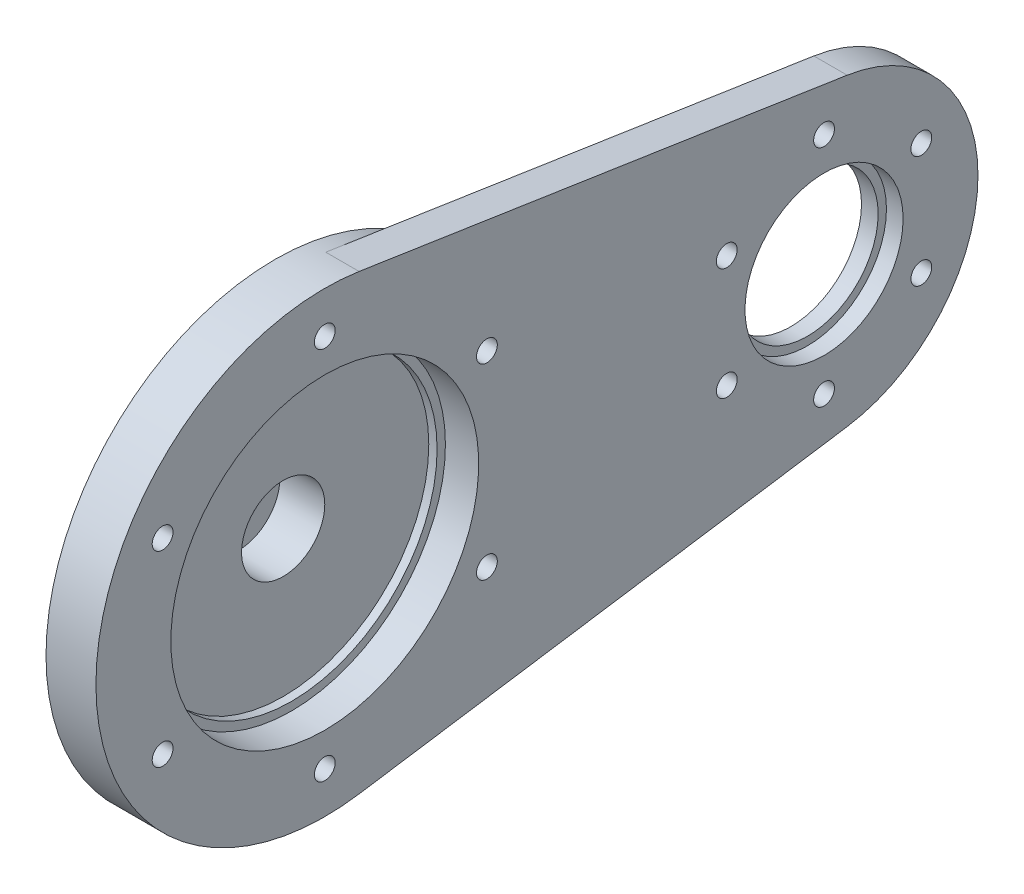
ISO-10303-21;
HEADER;
FILE_DESCRIPTION(('STEP AP214'),'2;1');
FILE_NAME('part.step','',(''),(''),'','','');
FILE_SCHEMA(('AUTOMOTIVE_DESIGN { 1 0 10303 214 1 1 1 1 }'));
ENDSEC;
DATA;
#1=APPLICATION_CONTEXT('core data for automotive mechanical design processes');
#2=APPLICATION_PROTOCOL_DEFINITION('international standard','automotive_design',2000,#1);
#3=PRODUCT_CONTEXT('',#1,'mechanical');
#4=PRODUCT('Part','Part','',(#3));
#5=PRODUCT_RELATED_PRODUCT_CATEGORY('part','',(#4));
#6=PRODUCT_DEFINITION_FORMATION('','',#4);
#7=PRODUCT_DEFINITION_CONTEXT('part definition',#1,'design');
#8=PRODUCT_DEFINITION('design','',#6,#7);
#9=PRODUCT_DEFINITION_SHAPE('','',#8);
#10=(LENGTH_UNIT() NAMED_UNIT(*) SI_UNIT(.MILLI.,.METRE.));
#11=(NAMED_UNIT(*) PLANE_ANGLE_UNIT() SI_UNIT($,.RADIAN.));
#12=(NAMED_UNIT(*) SI_UNIT($,.STERADIAN.) SOLID_ANGLE_UNIT());
#13=UNCERTAINTY_MEASURE_WITH_UNIT(LENGTH_MEASURE(1.E-05),#10,'distance_accuracy_value','');
#14=(GEOMETRIC_REPRESENTATION_CONTEXT(3) GLOBAL_UNCERTAINTY_ASSIGNED_CONTEXT((#13)) GLOBAL_UNIT_ASSIGNED_CONTEXT((#10,
#11,#12)) REPRESENTATION_CONTEXT('',''));
#15=CARTESIAN_POINT('',(0.,0.,0.));
#16=DIRECTION('',(0.,0.,1.));
#17=DIRECTION('',(1.,0.,0.));
#18=AXIS2_PLACEMENT_3D('',#15,#16,#17);
#19=CARTESIAN_POINT('',(-5.,0.,0.));
#20=DIRECTION('',(-1.,0.,0.));
#21=DIRECTION('',(0.,0.,1.));
#22=AXIS2_PLACEMENT_3D('',#19,#20,#21);
#23=PLANE('',#22);
#24=CARTESIAN_POINT('',(-5.,0.,0.));
#25=DIRECTION('',(-1.,0.,0.));
#26=DIRECTION('',(0.,0.,1.));
#27=AXIS2_PLACEMENT_3D('',#24,#25,#26);
#28=CIRCLE('',#27,9.4);
#29=CARTESIAN_POINT('',(-5.,0.,9.4));
#30=VERTEX_POINT('',#29);
#31=EDGE_CURVE('E11',#30,#30,#28,.T.);
#32=ORIENTED_EDGE('',*,*,#31,.T.);
#33=EDGE_LOOP('',(#32));
#34=FACE_BOUND('',#33,.T.);
#35=CARTESIAN_POINT('',(-5.,-7.,0.));
#36=DIRECTION('',(-1.,0.,0.));
#37=DIRECTION('',(0.,0.,1.));
#38=AXIS2_PLACEMENT_3D('',#35,#36,#37);
#39=CIRCLE('',#38,1.49999999999999);
#40=CARTESIAN_POINT('',(-5.,-7.,1.49999999999999));
#41=VERTEX_POINT('',#40);
#42=EDGE_CURVE('E109',#41,#41,#39,.T.);
#43=ORIENTED_EDGE('',*,*,#42,.F.);
#44=EDGE_LOOP('',(#43));
#45=FACE_BOUND('',#44,.T.);
#46=CARTESIAN_POINT('',(-5.,3.50000000000003,-6.06217782649105));
#47=DIRECTION('',(-1.,0.,0.));
#48=DIRECTION('',(0.,0.,1.));
#49=AXIS2_PLACEMENT_3D('',#46,#47,#48);
#50=CIRCLE('',#49,1.49999999999999);
#51=CARTESIAN_POINT('',(-5.,3.50000000000003,-4.56217782649107));
#52=VERTEX_POINT('',#51);
#53=EDGE_CURVE('E96',#52,#52,#50,.T.);
#54=ORIENTED_EDGE('',*,*,#53,.F.);
#55=EDGE_LOOP('',(#54));
#56=FACE_BOUND('',#55,.T.);
#57=CARTESIAN_POINT('',(-5.,3.49999999999994,6.0621778264911));
#58=DIRECTION('',(-1.,0.,0.));
#59=DIRECTION('',(0.,0.,1.));
#60=AXIS2_PLACEMENT_3D('',#57,#58,#59);
#61=CIRCLE('',#60,1.49999999999999);
#62=CARTESIAN_POINT('',(-5.,3.49999999999994,7.56217782649109));
#63=VERTEX_POINT('',#62);
#64=EDGE_CURVE('E97',#63,#63,#61,.T.);
#65=ORIENTED_EDGE('',*,*,#64,.F.);
#66=EDGE_LOOP('',(#65));
#67=FACE_BOUND('',#66,.T.);
#68=CARTESIAN_POINT('',(-5.,0.,0.));
#69=DIRECTION('',(1.,0.,0.));
#70=DIRECTION('',(0.,0.,-1.));
#71=AXIS2_PLACEMENT_3D('',#68,#69,#70);
#72=CIRCLE('',#71,2.65);
#73=CARTESIAN_POINT('',(-5.,0.,-2.65));
#74=VERTEX_POINT('',#73);
#75=EDGE_CURVE('E103',#74,#74,#72,.T.);
#76=ORIENTED_EDGE('',*,*,#75,.T.);
#77=EDGE_LOOP('',(#76));
#78=FACE_BOUND('',#77,.T.);
#79=ADVANCED_FACE('F36',(#34,#45,#56,#67,#78),#23,.T.);
#80=CARTESIAN_POINT('',(0.,0.,0.));
#81=DIRECTION('',(1.,0.,0.));
#82=DIRECTION('',(0.,0.,-1.));
#83=AXIS2_PLACEMENT_3D('',#80,#81,#82);
#84=PLANE('',#83);
#85=CARTESIAN_POINT('',(0.,0.,0.));
#86=DIRECTION('',(1.,0.,0.));
#87=DIRECTION('',(0.,0.,-1.));
#88=AXIS2_PLACEMENT_3D('',#85,#86,#87);
#89=CIRCLE('',#88,9.6);
#90=CARTESIAN_POINT('',(0.,0.,-9.6));
#91=VERTEX_POINT('',#90);
#92=EDGE_CURVE('E44',#91,#91,#89,.T.);
#93=ORIENTED_EDGE('',*,*,#92,.T.);
#94=EDGE_LOOP('',(#93));
#95=FACE_BOUND('',#94,.T.);
#96=CARTESIAN_POINT('',(0.,22.5,0.));
#97=DIRECTION('',(1.,0.,0.));
#98=DIRECTION('',(0.,0.,-1.));
#99=AXIS2_PLACEMENT_3D('',#96,#97,#98);
#100=CIRCLE('',#99,1.25);
#101=CARTESIAN_POINT('',(0.,22.5,-1.25));
#102=VERTEX_POINT('',#101);
#103=EDGE_CURVE('E189',#102,#102,#100,.T.);
#104=ORIENTED_EDGE('',*,*,#103,.T.);
#105=EDGE_LOOP('',(#104));
#106=FACE_BOUND('',#105,.T.);
#107=CARTESIAN_POINT('',(0.,11.25,-19.4855715851499));
#108=DIRECTION('',(1.,0.,0.));
#109=DIRECTION('',(0.,0.,-1.));
#110=AXIS2_PLACEMENT_3D('',#107,#108,#109);
#111=CIRCLE('',#110,1.25);
#112=CARTESIAN_POINT('',(0.,11.25,-20.7355715851499));
#113=VERTEX_POINT('',#112);
#114=EDGE_CURVE('E183',#113,#113,#111,.T.);
#115=ORIENTED_EDGE('',*,*,#114,.T.);
#116=EDGE_LOOP('',(#115));
#117=FACE_BOUND('',#116,.T.);
#118=CARTESIAN_POINT('',(0.,-11.2500000000001,-19.4855715851498));
#119=DIRECTION('',(1.,0.,0.));
#120=DIRECTION('',(0.,0.,-1.));
#121=AXIS2_PLACEMENT_3D('',#118,#119,#120);
#122=CIRCLE('',#121,1.25);
#123=CARTESIAN_POINT('',(0.,-11.2500000000001,-20.7355715851498));
#124=VERTEX_POINT('',#123);
#125=EDGE_CURVE('E179',#124,#124,#122,.T.);
#126=ORIENTED_EDGE('',*,*,#125,.T.);
#127=EDGE_LOOP('',(#126));
#128=FACE_BOUND('',#127,.T.);
#129=CARTESIAN_POINT('',(0.,-22.5,0.));
#130=DIRECTION('',(1.,0.,0.));
#131=DIRECTION('',(0.,0.,-1.));
#132=AXIS2_PLACEMENT_3D('',#129,#130,#131);
#133=CIRCLE('',#132,1.25);
#134=CARTESIAN_POINT('',(0.,-22.5,-1.25));
#135=VERTEX_POINT('',#134);
#136=EDGE_CURVE('E173',#135,#135,#133,.T.);
#137=ORIENTED_EDGE('',*,*,#136,.T.);
#138=EDGE_LOOP('',(#137));
#139=FACE_BOUND('',#138,.T.);
#140=CARTESIAN_POINT('',(0.,-11.2499999999998,19.48557158515));
#141=DIRECTION('',(1.,0.,0.));
#142=DIRECTION('',(0.,0.,-1.));
#143=AXIS2_PLACEMENT_3D('',#140,#141,#142);
#144=CIRCLE('',#143,1.25);
#145=CARTESIAN_POINT('',(0.,-11.2499999999998,18.23557158515));
#146=VERTEX_POINT('',#145);
#147=EDGE_CURVE('E169',#146,#146,#144,.T.);
#148=ORIENTED_EDGE('',*,*,#147,.T.);
#149=EDGE_LOOP('',(#148));
#150=FACE_BOUND('',#149,.T.);
#151=CARTESIAN_POINT('',(0.,11.2500000000002,19.4855715851497));
#152=DIRECTION('',(1.,0.,0.));
#153=DIRECTION('',(0.,0.,-1.));
#154=AXIS2_PLACEMENT_3D('',#151,#152,#153);
#155=CIRCLE('',#154,1.25);
#156=CARTESIAN_POINT('',(0.,11.2500000000002,18.2355715851497));
#157=VERTEX_POINT('',#156);
#158=EDGE_CURVE('E163',#157,#157,#155,.T.);
#159=ORIENTED_EDGE('',*,*,#158,.T.);
#160=EDGE_LOOP('',(#159));
#161=FACE_BOUND('',#160,.T.);
#162=CARTESIAN_POINT('',(0.,0.,0.));
#163=DIRECTION('',(-1.,0.,0.));
#164=DIRECTION('',(0.,0.,1.));
#165=AXIS2_PLACEMENT_3D('',#162,#163,#164);
#166=CIRCLE('',#165,25.);
#167=CARTESIAN_POINT('',(0.,0.,25.));
#168=VERTEX_POINT('',#167);
#169=EDGE_CURVE('E115',#168,#168,#166,.T.);
#170=ORIENTED_EDGE('',*,*,#169,.T.);
#171=EDGE_LOOP('',(#170));
#172=FACE_BOUND('',#171,.T.);
#173=ADVANCED_FACE('F256',(#95,#106,#117,#128,#139,#150,#161,#172),#84,.F.);
#174=CARTESIAN_POINT('',(2.,0.,0.));
#175=DIRECTION('',(-1.,0.,0.));
#176=DIRECTION('',(0.,0.,1.));
#177=AXIS2_PLACEMENT_3D('',#174,#175,#176);
#178=CYLINDRICAL_SURFACE('',#177,27.5);
#179=DIRECTION('',(1.,0.,0.));
#180=VECTOR('',#179,1.);
#181=CARTESIAN_POINT('',(3.,-27.1888649082671,-4.125));
#182=LINE('',#181,#180);
#183=CARTESIAN_POINT('',(3.,-27.1888649082671,-4.125));
#184=VERTEX_POINT('',#183);
#185=CARTESIAN_POINT('',(7.00000000000001,-27.1888649082671,-4.125));
#186=VERTEX_POINT('',#185);
#187=EDGE_CURVE('E217',#184,#186,#182,.T.);
#188=ORIENTED_EDGE('',*,*,#187,.T.);
#189=CARTESIAN_POINT('',(7.,0.,0.));
#190=DIRECTION('',(-1.,0.,0.));
#191=DIRECTION('',(0.,-1.,0.));
#192=AXIS2_PLACEMENT_3D('',#189,#190,#191);
#193=CIRCLE('',#192,27.5);
#194=CARTESIAN_POINT('',(7.,27.1888649082671,-4.125));
#195=VERTEX_POINT('',#194);
#196=EDGE_CURVE('E51',#186,#195,#193,.T.);
#197=ORIENTED_EDGE('',*,*,#196,.T.);
#198=DIRECTION('',(1.,0.,0.));
#199=VECTOR('',#198,1.);
#200=CARTESIAN_POINT('',(3.,27.1888649082671,-4.125));
#201=LINE('',#200,#199);
#202=CARTESIAN_POINT('',(3.,27.1888649082671,-4.125));
#203=VERTEX_POINT('',#202);
#204=EDGE_CURVE('E218',#203,#195,#201,.T.);
#205=ORIENTED_EDGE('',*,*,#204,.F.);
#206=CARTESIAN_POINT('',(3.,0.,0.));
#207=DIRECTION('',(-1.,0.,0.));
#208=DIRECTION('',(0.,0.,-1.));
#209=AXIS2_PLACEMENT_3D('',#206,#207,#208);
#210=CIRCLE('',#209,27.5);
#211=EDGE_CURVE('E59',#203,#184,#210,.T.);
#212=ORIENTED_EDGE('',*,*,#211,.T.);
#213=EDGE_LOOP('',(#188,#197,#205,#212));
#214=FACE_BOUND('',#213,.T.);
#215=CARTESIAN_POINT('',(1.,0.,0.));
#216=DIRECTION('',(-1.,0.,0.));
#217=DIRECTION('',(0.,0.,1.));
#218=AXIS2_PLACEMENT_3D('',#215,#216,#217);
#219=CIRCLE('',#218,27.5);
#220=CARTESIAN_POINT('',(1.,0.,27.5));
#221=VERTEX_POINT('',#220);
#222=EDGE_CURVE('E119',#221,#221,#219,.T.);
#223=ORIENTED_EDGE('',*,*,#222,.F.);
#224=EDGE_LOOP('',(#223));
#225=FACE_BOUND('',#224,.T.);
#226=ADVANCED_FACE('F325',(#214,#225),#178,.T.);
#227=CARTESIAN_POINT('',(7.,30.4496579795355,-1111.));
#228=DIRECTION('',(-1.,0.,0.));
#229=DIRECTION('',(0.,-1.,0.));
#230=AXIS2_PLACEMENT_3D('',#227,#228,#229);
#231=PLANE('',#230);
#232=CARTESIAN_POINT('',(7.,-6.7499999999999,-48.30865704891));
#233=DIRECTION('',(1.,0.,0.));
#234=DIRECTION('',(0.,0.,-1.));
#235=AXIS2_PLACEMENT_3D('',#232,#233,#234);
#236=CIRCLE('',#235,1.24999999999997);
#237=CARTESIAN_POINT('',(7.,-6.7499999999999,-49.55865704891));
#238=VERTEX_POINT('',#237);
#239=EDGE_CURVE('E130',#238,#238,#236,.T.);
#240=ORIENTED_EDGE('',*,*,#239,.F.);
#241=EDGE_LOOP('',(#240));
#242=FACE_BOUND('',#241,.T.);
#243=CARTESIAN_POINT('',(7.,13.5,-60.));
#244=DIRECTION('',(1.,0.,0.));
#245=DIRECTION('',(0.,0.,-1.));
#246=AXIS2_PLACEMENT_3D('',#243,#244,#245);
#247=CIRCLE('',#246,1.24999999999997);
#248=CARTESIAN_POINT('',(7.,13.5,-61.25));
#249=VERTEX_POINT('',#248);
#250=EDGE_CURVE('E154',#249,#249,#247,.T.);
#251=ORIENTED_EDGE('',*,*,#250,.F.);
#252=EDGE_LOOP('',(#251));
#253=FACE_BOUND('',#252,.T.);
#254=CARTESIAN_POINT('',(7.,-11.2499999999998,19.48557158515));
#255=DIRECTION('',(1.,0.,0.));
#256=DIRECTION('',(0.,0.,-1.));
#257=AXIS2_PLACEMENT_3D('',#254,#255,#256);
#258=CIRCLE('',#257,1.25);
#259=CARTESIAN_POINT('',(7.,-11.2499999999998,18.23557158515));
#260=VERTEX_POINT('',#259);
#261=EDGE_CURVE('E166',#260,#260,#258,.T.);
#262=ORIENTED_EDGE('',*,*,#261,.F.);
#263=EDGE_LOOP('',(#262));
#264=FACE_BOUND('',#263,.T.);
#265=CARTESIAN_POINT('',(7.,-22.5,0.));
#266=DIRECTION('',(1.,0.,0.));
#267=DIRECTION('',(0.,0.,-1.));
#268=AXIS2_PLACEMENT_3D('',#265,#266,#267);
#269=CIRCLE('',#268,1.25);
#270=CARTESIAN_POINT('',(7.,-22.5,-1.25));
#271=VERTEX_POINT('',#270);
#272=EDGE_CURVE('E170',#271,#271,#269,.T.);
#273=ORIENTED_EDGE('',*,*,#272,.F.);
#274=EDGE_LOOP('',(#273));
#275=FACE_BOUND('',#274,.T.);
#276=CARTESIAN_POINT('',(7.,-11.2500000000001,-19.4855715851498));
#277=DIRECTION('',(1.,0.,0.));
#278=DIRECTION('',(0.,0.,-1.));
#279=AXIS2_PLACEMENT_3D('',#276,#277,#278);
#280=CIRCLE('',#279,1.25);
#281=CARTESIAN_POINT('',(7.,-11.2500000000001,-20.7355715851498));
#282=VERTEX_POINT('',#281);
#283=EDGE_CURVE('E176',#282,#282,#280,.T.);
#284=ORIENTED_EDGE('',*,*,#283,.F.);
#285=EDGE_LOOP('',(#284));
#286=FACE_BOUND('',#285,.T.);
#287=CARTESIAN_POINT('',(7.,22.5,0.));
#288=DIRECTION('',(1.,0.,0.));
#289=DIRECTION('',(0.,0.,-1.));
#290=AXIS2_PLACEMENT_3D('',#287,#288,#289);
#291=CIRCLE('',#290,1.25);
#292=CARTESIAN_POINT('',(7.,22.5,-1.25));
#293=VERTEX_POINT('',#292);
#294=EDGE_CURVE('E186',#293,#293,#291,.T.);
#295=ORIENTED_EDGE('',*,*,#294,.F.);
#296=EDGE_LOOP('',(#295));
#297=FACE_BOUND('',#296,.T.);
#298=CARTESIAN_POINT('',(7.,0.,0.));
#299=DIRECTION('',(-1.,0.,0.));
#300=DIRECTION('',(0.,-1.,0.));
#301=AXIS2_PLACEMENT_3D('',#298,#299,#300);
#302=CIRCLE('',#301,18.5);
#303=CARTESIAN_POINT('',(7.00000000000001,-18.5,0.));
#304=VERTEX_POINT('',#303);
#305=EDGE_CURVE('E200',#304,#304,#302,.T.);
#306=ORIENTED_EDGE('',*,*,#305,.T.);
#307=EDGE_LOOP('',(#306));
#308=FACE_BOUND('',#307,.T.);
#309=CARTESIAN_POINT('',(7.,0.,-60.));
#310=DIRECTION('',(-1.,0.,0.));
#311=DIRECTION('',(0.,-1.,0.));
#312=AXIS2_PLACEMENT_3D('',#309,#310,#311);
#313=CIRCLE('',#312,9.49999999999999);
#314=CARTESIAN_POINT('',(7.00000000000001,-9.49999999999999,-60.));
#315=VERTEX_POINT('',#314);
#316=EDGE_CURVE('E192',#315,#315,#313,.F.);
#317=ORIENTED_EDGE('',*,*,#316,.F.);
#318=EDGE_LOOP('',(#317));
#319=FACE_BOUND('',#318,.T.);
#320=DIRECTION('',(0.,0.15,-0.98868599666426));
#321=VECTOR('',#320,1.);
#322=CARTESIAN_POINT('',(7.00000000000001,-27.1888649082671,-4.125));
#323=LINE('',#322,#321);
#324=CARTESIAN_POINT('',(7.00000000000001,-18.2906909382888,-62.775));
#325=VERTEX_POINT('',#324);
#326=EDGE_CURVE('E193',#186,#325,#323,.T.);
#327=ORIENTED_EDGE('',*,*,#326,.T.);
#328=CARTESIAN_POINT('',(7.,0.,-60.));
#329=DIRECTION('',(-1.,0.,0.));
#330=DIRECTION('',(0.,-1.,0.));
#331=AXIS2_PLACEMENT_3D('',#328,#329,#330);
#332=CIRCLE('',#331,18.5);
#333=CARTESIAN_POINT('',(7.,18.2906909382888,-62.775));
#334=VERTEX_POINT('',#333);
#335=EDGE_CURVE('E195',#325,#334,#332,.F.);
#336=ORIENTED_EDGE('',*,*,#335,.T.);
#337=DIRECTION('',(0.,0.15,0.98868599666426));
#338=VECTOR('',#337,1.);
#339=CARTESIAN_POINT('',(7.,27.1888649082671,-4.125));
#340=LINE('',#339,#338);
#341=EDGE_CURVE('E197',#334,#195,#340,.T.);
#342=ORIENTED_EDGE('',*,*,#341,.T.);
#343=ORIENTED_EDGE('',*,*,#196,.F.);
#344=EDGE_LOOP('',(#327,#336,#342,#343));
#345=FACE_BOUND('',#344,.T.);
#346=CARTESIAN_POINT('',(7.,11.25,-19.4855715851499));
#347=DIRECTION('',(1.,0.,0.));
#348=DIRECTION('',(0.,0.,-1.));
#349=AXIS2_PLACEMENT_3D('',#346,#347,#348);
#350=CIRCLE('',#349,1.25);
#351=CARTESIAN_POINT('',(7.,11.25,-20.7355715851499));
#352=VERTEX_POINT('',#351);
#353=EDGE_CURVE('E180',#352,#352,#350,.T.);
#354=ORIENTED_EDGE('',*,*,#353,.F.);
#355=EDGE_LOOP('',(#354));
#356=FACE_BOUND('',#355,.T.);
#357=CARTESIAN_POINT('',(7.,11.2500000000002,19.4855715851497));
#358=DIRECTION('',(1.,0.,0.));
#359=DIRECTION('',(0.,0.,-1.));
#360=AXIS2_PLACEMENT_3D('',#357,#358,#359);
#361=CIRCLE('',#360,1.25);
#362=CARTESIAN_POINT('',(7.,11.2500000000002,18.2355715851497));
#363=VERTEX_POINT('',#362);
#364=EDGE_CURVE('E160',#363,#363,#361,.T.);
#365=ORIENTED_EDGE('',*,*,#364,.F.);
#366=EDGE_LOOP('',(#365));
#367=FACE_BOUND('',#366,.T.);
#368=CARTESIAN_POINT('',(7.,6.74999999999997,-71.6913429510899));
#369=DIRECTION('',(1.,0.,0.));
#370=DIRECTION('',(0.,0.,-1.));
#371=AXIS2_PLACEMENT_3D('',#368,#369,#370);
#372=CIRCLE('',#371,1.24999999999997);
#373=CARTESIAN_POINT('',(7.,6.74999999999997,-72.9413429510899));
#374=VERTEX_POINT('',#373);
#375=EDGE_CURVE('E148',#374,#374,#372,.T.);
#376=ORIENTED_EDGE('',*,*,#375,.F.);
#377=EDGE_LOOP('',(#376));
#378=FACE_BOUND('',#377,.T.);
#379=CARTESIAN_POINT('',(7.,-6.75000000000005,-71.6913429510899));
#380=DIRECTION('',(1.,0.,0.));
#381=DIRECTION('',(0.,0.,-1.));
#382=AXIS2_PLACEMENT_3D('',#379,#380,#381);
#383=CIRCLE('',#382,1.24999999999997);
#384=CARTESIAN_POINT('',(7.,-6.75000000000005,-72.9413429510899));
#385=VERTEX_POINT('',#384);
#386=EDGE_CURVE('E142',#385,#385,#383,.T.);
#387=ORIENTED_EDGE('',*,*,#386,.F.);
#388=EDGE_LOOP('',(#387));
#389=FACE_BOUND('',#388,.T.);
#390=CARTESIAN_POINT('',(7.,-13.5,-60.));
#391=DIRECTION('',(1.,0.,0.));
#392=DIRECTION('',(0.,0.,-1.));
#393=AXIS2_PLACEMENT_3D('',#390,#391,#392);
#394=CIRCLE('',#393,1.24999999999997);
#395=CARTESIAN_POINT('',(7.,-13.5,-61.25));
#396=VERTEX_POINT('',#395);
#397=EDGE_CURVE('E136',#396,#396,#394,.T.);
#398=ORIENTED_EDGE('',*,*,#397,.F.);
#399=EDGE_LOOP('',(#398));
#400=FACE_BOUND('',#399,.T.);
#401=CARTESIAN_POINT('',(7.,6.75000000000014,-48.3086570489102));
#402=DIRECTION('',(1.,0.,0.));
#403=DIRECTION('',(0.,0.,-1.));
#404=AXIS2_PLACEMENT_3D('',#401,#402,#403);
#405=CIRCLE('',#404,1.24999999999997);
#406=CARTESIAN_POINT('',(7.,6.75000000000014,-49.5586570489101));
#407=VERTEX_POINT('',#406);
#408=EDGE_CURVE('E124',#407,#407,#405,.T.);
#409=ORIENTED_EDGE('',*,*,#408,.F.);
#410=EDGE_LOOP('',(#409));
#411=FACE_BOUND('',#410,.T.);
#412=ADVANCED_FACE('F317',(#242,#253,#264,#275,#286,#297,#308,#319,#345,#356,#367,#378,#389,
#400,#411),#231,.F.);
#413=CARTESIAN_POINT('',(3.,0.,0.));
#414=DIRECTION('',(1.,0.,0.));
#415=DIRECTION('',(0.,0.,-1.));
#416=AXIS2_PLACEMENT_3D('',#413,#414,#415);
#417=PLANE('',#416);
#418=CARTESIAN_POINT('',(3.,0.,0.));
#419=DIRECTION('',(1.,0.,0.));
#420=DIRECTION('',(0.,0.,-1.));
#421=AXIS2_PLACEMENT_3D('',#418,#419,#420);
#422=CIRCLE('',#421,17.5);
#423=CARTESIAN_POINT('',(3.,0.,-17.5));
#424=VERTEX_POINT('',#423);
#425=EDGE_CURVE('E232',#424,#424,#422,.T.);
#426=ORIENTED_EDGE('',*,*,#425,.F.);
#427=EDGE_LOOP('',(#426));
#428=FACE_BOUND('',#427,.T.);
#429=CARTESIAN_POINT('',(3.,0.,0.));
#430=DIRECTION('',(1.,0.,0.));
#431=DIRECTION('',(0.,0.,-1.));
#432=AXIS2_PLACEMENT_3D('',#429,#430,#431);
#433=CIRCLE('',#432,18.5);
#434=CARTESIAN_POINT('',(3.,0.,-18.5));
#435=VERTEX_POINT('',#434);
#436=EDGE_CURVE('E221',#435,#435,#433,.T.);
#437=ORIENTED_EDGE('',*,*,#436,.T.);
#438=EDGE_LOOP('',(#437));
#439=FACE_BOUND('',#438,.T.);
#440=ADVANCED_FACE('F311',(#428,#439),#417,.T.);
#441=CARTESIAN_POINT('',(3.,0.,0.));
#442=DIRECTION('',(-1.,0.,0.));
#443=DIRECTION('',(0.,0.,1.));
#444=AXIS2_PLACEMENT_3D('',#441,#442,#443);
#445=CYLINDRICAL_SURFACE('',#444,17.5);
#446=ORIENTED_EDGE('',*,*,#425,.T.);
#447=EDGE_LOOP('',(#446));
#448=FACE_BOUND('',#447,.T.);
#449=CARTESIAN_POINT('',(2.,0.,0.));
#450=DIRECTION('',(1.,0.,0.));
#451=DIRECTION('',(0.,0.,-1.));
#452=AXIS2_PLACEMENT_3D('',#449,#450,#451);
#453=CIRCLE('',#452,17.5);
#454=CARTESIAN_POINT('',(2.,0.,-17.5));
#455=VERTEX_POINT('',#454);
#456=EDGE_CURVE('E235',#455,#455,#453,.F.);
#457=ORIENTED_EDGE('',*,*,#456,.T.);
#458=EDGE_LOOP('',(#457));
#459=FACE_BOUND('',#458,.T.);
#460=ADVANCED_FACE('F306',(#448,#459),#445,.F.);
#461=CARTESIAN_POINT('',(2.,0.,0.));
#462=DIRECTION('',(1.,0.,0.));
#463=DIRECTION('',(0.,0.,-1.));
#464=AXIS2_PLACEMENT_3D('',#461,#462,#463);
#465=PLANE('',#464);
#466=CARTESIAN_POINT('',(2.,0.,0.));
#467=DIRECTION('',(1.,0.,0.));
#468=DIRECTION('',(0.,0.,-1.));
#469=AXIS2_PLACEMENT_3D('',#466,#467,#468);
#470=CIRCLE('',#469,5.);
#471=CARTESIAN_POINT('',(2.,0.,-5.));
#472=VERTEX_POINT('',#471);
#473=EDGE_CURVE('E297',#472,#472,#470,.T.);
#474=ORIENTED_EDGE('',*,*,#473,.F.);
#475=EDGE_LOOP('',(#474));
#476=FACE_BOUND('',#475,.T.);
#477=ORIENTED_EDGE('',*,*,#456,.F.);
#478=EDGE_LOOP('',(#477));
#479=FACE_BOUND('',#478,.T.);
#480=ADVANCED_FACE('F303',(#476,#479),#465,.T.);
#481=CARTESIAN_POINT('',(10.,0.,0.));
#482=DIRECTION('',(-1.,0.,0.));
#483=DIRECTION('',(0.,0.,1.));
#484=AXIS2_PLACEMENT_3D('',#481,#482,#483);
#485=CYLINDRICAL_SURFACE('',#484,18.5);
#486=ORIENTED_EDGE('',*,*,#305,.F.);
#487=EDGE_LOOP('',(#486));
#488=FACE_BOUND('',#487,.T.);
#489=ORIENTED_EDGE('',*,*,#436,.F.);
#490=EDGE_LOOP('',(#489));
#491=FACE_BOUND('',#490,.T.);
#492=ADVANCED_FACE('F269',(#488,#491),#485,.F.);
#493=CARTESIAN_POINT('',(-5.,0.,0.));
#494=DIRECTION('',(1.,0.,0.));
#495=DIRECTION('',(0.,0.,-1.));
#496=AXIS2_PLACEMENT_3D('',#493,#494,#495);
#497=CYLINDRICAL_SURFACE('',#496,9.5);
#498=CARTESIAN_POINT('',(-0.1,0.,0.));
#499=DIRECTION('',(1.,0.,0.));
#500=DIRECTION('',(0.,0.,-1.));
#501=AXIS2_PLACEMENT_3D('',#498,#499,#500);
#502=CIRCLE('',#501,9.5);
#503=CARTESIAN_POINT('',(-0.1,0.,-9.5));
#504=VERTEX_POINT('',#503);
#505=EDGE_CURVE('E251',#504,#504,#502,.F.);
#506=ORIENTED_EDGE('',*,*,#505,.T.);
#507=EDGE_LOOP('',(#506));
#508=FACE_BOUND('',#507,.T.);
#509=CARTESIAN_POINT('',(-4.9,0.,0.));
#510=DIRECTION('',(-1.,0.,0.));
#511=DIRECTION('',(0.,0.,1.));
#512=AXIS2_PLACEMENT_3D('',#509,#510,#511);
#513=CIRCLE('',#512,9.5);
#514=CARTESIAN_POINT('',(-4.9,0.,9.5));
#515=VERTEX_POINT('',#514);
#516=EDGE_CURVE('E238',#515,#515,#513,.F.);
#517=ORIENTED_EDGE('',*,*,#516,.T.);
#518=EDGE_LOOP('',(#517));
#519=FACE_BOUND('',#518,.T.);
#520=ADVANCED_FACE('F265',(#508,#519),#497,.T.);
#521=CARTESIAN_POINT('',(3.,0.,0.));
#522=DIRECTION('',(1.,0.,0.));
#523=DIRECTION('',(0.,0.,-1.));
#524=AXIS2_PLACEMENT_3D('',#521,#522,#523);
#525=PLANE('',#524);
#526=CARTESIAN_POINT('',(3.,6.75000000000014,-48.3086570489102));
#527=DIRECTION('',(1.,0.,0.));
#528=DIRECTION('',(0.,0.,-1.));
#529=AXIS2_PLACEMENT_3D('',#526,#527,#528);
#530=CIRCLE('',#529,1.24999999999997);
#531=CARTESIAN_POINT('',(3.,6.75000000000014,-49.5586570489101));
#532=VERTEX_POINT('',#531);
#533=EDGE_CURVE('E127',#532,#532,#530,.T.);
#534=ORIENTED_EDGE('',*,*,#533,.T.);
#535=EDGE_LOOP('',(#534));
#536=FACE_BOUND('',#535,.T.);
#537=CARTESIAN_POINT('',(3.,-6.7499999999999,-48.30865704891));
#538=DIRECTION('',(1.,0.,0.));
#539=DIRECTION('',(0.,0.,-1.));
#540=AXIS2_PLACEMENT_3D('',#537,#538,#539);
#541=CIRCLE('',#540,1.24999999999997);
#542=CARTESIAN_POINT('',(3.,-6.7499999999999,-49.55865704891));
#543=VERTEX_POINT('',#542);
#544=EDGE_CURVE('E133',#543,#543,#541,.T.);
#545=ORIENTED_EDGE('',*,*,#544,.T.);
#546=EDGE_LOOP('',(#545));
#547=FACE_BOUND('',#546,.T.);
#548=CARTESIAN_POINT('',(3.,-13.5,-60.));
#549=DIRECTION('',(1.,0.,0.));
#550=DIRECTION('',(0.,0.,-1.));
#551=AXIS2_PLACEMENT_3D('',#548,#549,#550);
#552=CIRCLE('',#551,1.24999999999997);
#553=CARTESIAN_POINT('',(3.,-13.5,-61.25));
#554=VERTEX_POINT('',#553);
#555=EDGE_CURVE('E139',#554,#554,#552,.T.);
#556=ORIENTED_EDGE('',*,*,#555,.T.);
#557=EDGE_LOOP('',(#556));
#558=FACE_BOUND('',#557,.T.);
#559=CARTESIAN_POINT('',(3.,-6.75000000000005,-71.6913429510899));
#560=DIRECTION('',(1.,0.,0.));
#561=DIRECTION('',(0.,0.,-1.));
#562=AXIS2_PLACEMENT_3D('',#559,#560,#561);
#563=CIRCLE('',#562,1.24999999999997);
#564=CARTESIAN_POINT('',(3.,-6.75000000000005,-72.9413429510899));
#565=VERTEX_POINT('',#564);
#566=EDGE_CURVE('E145',#565,#565,#563,.T.);
#567=ORIENTED_EDGE('',*,*,#566,.T.);
#568=EDGE_LOOP('',(#567));
#569=FACE_BOUND('',#568,.T.);
#570=CARTESIAN_POINT('',(3.,6.74999999999997,-71.6913429510899));
#571=DIRECTION('',(1.,0.,0.));
#572=DIRECTION('',(0.,0.,-1.));
#573=AXIS2_PLACEMENT_3D('',#570,#571,#572);
#574=CIRCLE('',#573,1.24999999999997);
#575=CARTESIAN_POINT('',(3.,6.74999999999997,-72.9413429510899));
#576=VERTEX_POINT('',#575);
#577=EDGE_CURVE('E151',#576,#576,#574,.T.);
#578=ORIENTED_EDGE('',*,*,#577,.T.);
#579=EDGE_LOOP('',(#578));
#580=FACE_BOUND('',#579,.T.);
#581=CARTESIAN_POINT('',(3.,13.5,-60.));
#582=DIRECTION('',(1.,0.,0.));
#583=DIRECTION('',(0.,0.,-1.));
#584=AXIS2_PLACEMENT_3D('',#581,#582,#583);
#585=CIRCLE('',#584,1.24999999999997);
#586=CARTESIAN_POINT('',(3.,13.5,-61.25));
#587=VERTEX_POINT('',#586);
#588=EDGE_CURVE('E157',#587,#587,#585,.T.);
#589=ORIENTED_EDGE('',*,*,#588,.T.);
#590=EDGE_LOOP('',(#589));
#591=FACE_BOUND('',#590,.T.);
#592=CARTESIAN_POINT('',(3.,0.,-60.));
#593=DIRECTION('',(1.,0.,0.));
#594=DIRECTION('',(0.,0.,-1.));
#595=AXIS2_PLACEMENT_3D('',#592,#593,#594);
#596=CIRCLE('',#595,8.5);
#597=CARTESIAN_POINT('',(3.,0.,-68.5));
#598=VERTEX_POINT('',#597);
#599=EDGE_CURVE('E209',#598,#598,#596,.T.);
#600=ORIENTED_EDGE('',*,*,#599,.T.);
#601=EDGE_LOOP('',(#600));
#602=FACE_BOUND('',#601,.T.);
#603=ORIENTED_EDGE('',*,*,#211,.F.);
#604=DIRECTION('',(0.,0.15,0.988685996664259));
#605=VECTOR('',#604,1.);
#606=CARTESIAN_POINT('',(3.,27.1888649082671,-4.125));
#607=LINE('',#606,#605);
#608=CARTESIAN_POINT('',(3.,18.2906909382888,-62.775));
#609=VERTEX_POINT('',#608);
#610=EDGE_CURVE('E215',#609,#203,#607,.T.);
#611=ORIENTED_EDGE('',*,*,#610,.F.);
#612=CARTESIAN_POINT('',(3.,0.,-60.));
#613=DIRECTION('',(1.,0.,0.));
#614=DIRECTION('',(0.,0.,-1.));
#615=AXIS2_PLACEMENT_3D('',#612,#613,#614);
#616=CIRCLE('',#615,18.5);
#617=CARTESIAN_POINT('',(3.,-18.2906909382888,-62.775));
#618=VERTEX_POINT('',#617);
#619=EDGE_CURVE('E212',#618,#609,#616,.T.);
#620=ORIENTED_EDGE('',*,*,#619,.F.);
#621=DIRECTION('',(0.,0.15,-0.988685996664259));
#622=VECTOR('',#621,1.);
#623=CARTESIAN_POINT('',(3.,-27.1888649082671,-4.125));
#624=LINE('',#623,#622);
#625=EDGE_CURVE('E208',#184,#618,#624,.T.);
#626=ORIENTED_EDGE('',*,*,#625,.F.);
#627=EDGE_LOOP('',(#603,#611,#620,#626));
#628=FACE_BOUND('',#627,.T.);
#629=ADVANCED_FACE('F268',(#536,#547,#558,#569,#580,#591,#602,#628),#525,.F.);
#630=CARTESIAN_POINT('',(3.,-27.1888649082671,-4.125));
#631=DIRECTION('',(0.,-0.988685996664259,-0.15));
#632=DIRECTION('',(0.,0.15,-0.98868599666426));
#633=AXIS2_PLACEMENT_3D('',#630,#631,#632);
#634=PLANE('',#633);
#635=ORIENTED_EDGE('',*,*,#326,.F.);
#636=ORIENTED_EDGE('',*,*,#187,.F.);
#637=ORIENTED_EDGE('',*,*,#625,.T.);
#638=DIRECTION('',(1.,0.,0.));
#639=VECTOR('',#638,1.);
#640=CARTESIAN_POINT('',(3.,-18.2906909382888,-62.775));
#641=LINE('',#640,#639);
#642=EDGE_CURVE('E225',#618,#325,#641,.T.);
#643=ORIENTED_EDGE('',*,*,#642,.T.);
#644=EDGE_LOOP('',(#635,#636,#637,#643));
#645=FACE_BOUND('',#644,.T.);
#646=ADVANCED_FACE('F411',(#645),#634,.T.);
#647=CARTESIAN_POINT('',(3.,0.,-60.));
#648=DIRECTION('',(1.,0.,0.));
#649=DIRECTION('',(0.,0.,-1.));
#650=AXIS2_PLACEMENT_3D('',#647,#648,#649);
#651=CYLINDRICAL_SURFACE('',#650,18.5);
#652=ORIENTED_EDGE('',*,*,#335,.F.);
#653=ORIENTED_EDGE('',*,*,#642,.F.);
#654=ORIENTED_EDGE('',*,*,#619,.T.);
#655=DIRECTION('',(1.,0.,0.));
#656=VECTOR('',#655,1.);
#657=CARTESIAN_POINT('',(3.,18.2906909382888,-62.775));
#658=LINE('',#657,#656);
#659=EDGE_CURVE('E222',#609,#334,#658,.T.);
#660=ORIENTED_EDGE('',*,*,#659,.T.);
#661=EDGE_LOOP('',(#652,#653,#654,#660));
#662=FACE_BOUND('',#661,.T.);
#663=ADVANCED_FACE('F415',(#662),#651,.T.);
#664=CARTESIAN_POINT('',(3.,27.1888649082671,-4.125));
#665=DIRECTION('',(0.,0.988685996664259,-0.15));
#666=DIRECTION('',(0.,0.15,0.98868599666426));
#667=AXIS2_PLACEMENT_3D('',#664,#665,#666);
#668=PLANE('',#667);
#669=ORIENTED_EDGE('',*,*,#341,.F.);
#670=ORIENTED_EDGE('',*,*,#659,.F.);
#671=ORIENTED_EDGE('',*,*,#610,.T.);
#672=ORIENTED_EDGE('',*,*,#204,.T.);
#673=EDGE_LOOP('',(#669,#670,#671,#672));
#674=FACE_BOUND('',#673,.T.);
#675=ADVANCED_FACE('F407',(#674),#668,.T.);
#676=CARTESIAN_POINT('',(-103.5,0.,-60.));
#677=DIRECTION('',(1.,0.,0.));
#678=DIRECTION('',(0.,0.,-1.));
#679=AXIS2_PLACEMENT_3D('',#676,#677,#678);
#680=CYLINDRICAL_SURFACE('',#679,8.5);
#681=ORIENTED_EDGE('',*,*,#599,.F.);
#682=EDGE_LOOP('',(#681));
#683=FACE_BOUND('',#682,.T.);
#684=CARTESIAN_POINT('',(5.,0.,-60.));
#685=DIRECTION('',(1.,0.,0.));
#686=DIRECTION('',(0.,0.,-1.));
#687=AXIS2_PLACEMENT_3D('',#684,#685,#686);
#688=CIRCLE('',#687,8.5);
#689=CARTESIAN_POINT('',(5.,0.,-68.5));
#690=VERTEX_POINT('',#689);
#691=EDGE_CURVE('E206',#690,#690,#688,.F.);
#692=ORIENTED_EDGE('',*,*,#691,.F.);
#693=EDGE_LOOP('',(#692));
#694=FACE_BOUND('',#693,.T.);
#695=ADVANCED_FACE('F400',(#683,#694),#680,.F.);
#696=CARTESIAN_POINT('',(5.,0.,-60.));
#697=DIRECTION('',(1.,0.,0.));
#698=DIRECTION('',(0.,0.,-1.));
#699=AXIS2_PLACEMENT_3D('',#696,#697,#698);
#700=PLANE('',#699);
#701=CARTESIAN_POINT('',(5.,0.,-60.));
#702=DIRECTION('',(1.,0.,0.));
#703=DIRECTION('',(0.,0.,-1.));
#704=AXIS2_PLACEMENT_3D('',#701,#702,#703);
#705=CIRCLE('',#704,9.49999999999999);
#706=CARTESIAN_POINT('',(5.,0.,-69.5));
#707=VERTEX_POINT('',#706);
#708=EDGE_CURVE('E203',#707,#707,#705,.T.);
#709=ORIENTED_EDGE('',*,*,#708,.T.);
#710=EDGE_LOOP('',(#709));
#711=FACE_BOUND('',#710,.T.);
#712=ORIENTED_EDGE('',*,*,#691,.T.);
#713=EDGE_LOOP('',(#712));
#714=FACE_BOUND('',#713,.T.);
#715=ADVANCED_FACE('F397',(#711,#714),#700,.T.);
#716=CARTESIAN_POINT('',(5.,0.,-60.));
#717=DIRECTION('',(1.,0.,0.));
#718=DIRECTION('',(0.,0.,-1.));
#719=AXIS2_PLACEMENT_3D('',#716,#717,#718);
#720=CYLINDRICAL_SURFACE('',#719,9.49999999999999);
#721=ORIENTED_EDGE('',*,*,#316,.T.);
#722=EDGE_LOOP('',(#721));
#723=FACE_BOUND('',#722,.T.);
#724=ORIENTED_EDGE('',*,*,#708,.F.);
#725=EDGE_LOOP('',(#724));
#726=FACE_BOUND('',#725,.T.);
#727=ADVANCED_FACE('F394',(#723,#726),#720,.F.);
#728=CARTESIAN_POINT('',(7.,22.5,0.));
#729=DIRECTION('',(1.,0.,0.));
#730=DIRECTION('',(0.,0.,-1.));
#731=AXIS2_PLACEMENT_3D('',#728,#729,#730);
#732=CYLINDRICAL_SURFACE('',#731,1.25);
#733=ORIENTED_EDGE('',*,*,#294,.T.);
#734=EDGE_LOOP('',(#733));
#735=FACE_BOUND('',#734,.T.);
#736=ORIENTED_EDGE('',*,*,#103,.F.);
#737=EDGE_LOOP('',(#736));
#738=FACE_BOUND('',#737,.T.);
#739=ADVANCED_FACE('F391',(#735,#738),#732,.F.);
#740=CARTESIAN_POINT('',(7.,11.25,-19.4855715851499));
#741=DIRECTION('',(1.,0.,0.));
#742=DIRECTION('',(0.,0.,-1.));
#743=AXIS2_PLACEMENT_3D('',#740,#741,#742);
#744=CYLINDRICAL_SURFACE('',#743,1.25);
#745=ORIENTED_EDGE('',*,*,#353,.T.);
#746=EDGE_LOOP('',(#745));
#747=FACE_BOUND('',#746,.T.);
#748=ORIENTED_EDGE('',*,*,#114,.F.);
#749=EDGE_LOOP('',(#748));
#750=FACE_BOUND('',#749,.T.);
#751=ADVANCED_FACE('F387',(#747,#750),#744,.F.);
#752=CARTESIAN_POINT('',(7.,-11.2500000000001,-19.4855715851498));
#753=DIRECTION('',(1.,0.,0.));
#754=DIRECTION('',(0.,0.,-1.));
#755=AXIS2_PLACEMENT_3D('',#752,#753,#754);
#756=CYLINDRICAL_SURFACE('',#755,1.25);
#757=ORIENTED_EDGE('',*,*,#283,.T.);
#758=EDGE_LOOP('',(#757));
#759=FACE_BOUND('',#758,.T.);
#760=ORIENTED_EDGE('',*,*,#125,.F.);
#761=EDGE_LOOP('',(#760));
#762=FACE_BOUND('',#761,.T.);
#763=ADVANCED_FACE('F383',(#759,#762),#756,.F.);
#764=CARTESIAN_POINT('',(7.,-22.5,0.));
#765=DIRECTION('',(1.,0.,0.));
#766=DIRECTION('',(0.,0.,-1.));
#767=AXIS2_PLACEMENT_3D('',#764,#765,#766);
#768=CYLINDRICAL_SURFACE('',#767,1.25);
#769=ORIENTED_EDGE('',*,*,#272,.T.);
#770=EDGE_LOOP('',(#769));
#771=FACE_BOUND('',#770,.T.);
#772=ORIENTED_EDGE('',*,*,#136,.F.);
#773=EDGE_LOOP('',(#772));
#774=FACE_BOUND('',#773,.T.);
#775=ADVANCED_FACE('F379',(#771,#774),#768,.F.);
#776=CARTESIAN_POINT('',(7.,-11.2499999999998,19.48557158515));
#777=DIRECTION('',(1.,0.,0.));
#778=DIRECTION('',(0.,0.,-1.));
#779=AXIS2_PLACEMENT_3D('',#776,#777,#778);
#780=CYLINDRICAL_SURFACE('',#779,1.25);
#781=ORIENTED_EDGE('',*,*,#261,.T.);
#782=EDGE_LOOP('',(#781));
#783=FACE_BOUND('',#782,.T.);
#784=ORIENTED_EDGE('',*,*,#147,.F.);
#785=EDGE_LOOP('',(#784));
#786=FACE_BOUND('',#785,.T.);
#787=ADVANCED_FACE('F375',(#783,#786),#780,.F.);
#788=CARTESIAN_POINT('',(7.,11.2500000000002,19.4855715851497));
#789=DIRECTION('',(1.,0.,0.));
#790=DIRECTION('',(0.,0.,-1.));
#791=AXIS2_PLACEMENT_3D('',#788,#789,#790);
#792=CYLINDRICAL_SURFACE('',#791,1.25);
#793=ORIENTED_EDGE('',*,*,#364,.T.);
#794=EDGE_LOOP('',(#793));
#795=FACE_BOUND('',#794,.T.);
#796=ORIENTED_EDGE('',*,*,#158,.F.);
#797=EDGE_LOOP('',(#796));
#798=FACE_BOUND('',#797,.T.);
#799=ADVANCED_FACE('F371',(#795,#798),#792,.F.);
#800=CARTESIAN_POINT('',(7.,13.5,-60.));
#801=DIRECTION('',(1.,0.,0.));
#802=DIRECTION('',(0.,0.,-1.));
#803=AXIS2_PLACEMENT_3D('',#800,#801,#802);
#804=CYLINDRICAL_SURFACE('',#803,1.24999999999997);
#805=ORIENTED_EDGE('',*,*,#250,.T.);
#806=EDGE_LOOP('',(#805));
#807=FACE_BOUND('',#806,.T.);
#808=ORIENTED_EDGE('',*,*,#588,.F.);
#809=EDGE_LOOP('',(#808));
#810=FACE_BOUND('',#809,.T.);
#811=ADVANCED_FACE('F367',(#807,#810),#804,.F.);
#812=CARTESIAN_POINT('',(7.,6.74999999999997,-71.6913429510899));
#813=DIRECTION('',(1.,0.,0.));
#814=DIRECTION('',(0.,0.,-1.));
#815=AXIS2_PLACEMENT_3D('',#812,#813,#814);
#816=CYLINDRICAL_SURFACE('',#815,1.24999999999997);
#817=ORIENTED_EDGE('',*,*,#375,.T.);
#818=EDGE_LOOP('',(#817));
#819=FACE_BOUND('',#818,.T.);
#820=ORIENTED_EDGE('',*,*,#577,.F.);
#821=EDGE_LOOP('',(#820));
#822=FACE_BOUND('',#821,.T.);
#823=ADVANCED_FACE('F363',(#819,#822),#816,.F.);
#824=CARTESIAN_POINT('',(7.,-6.75000000000005,-71.6913429510899));
#825=DIRECTION('',(1.,0.,0.));
#826=DIRECTION('',(0.,0.,-1.));
#827=AXIS2_PLACEMENT_3D('',#824,#825,#826);
#828=CYLINDRICAL_SURFACE('',#827,1.24999999999997);
#829=ORIENTED_EDGE('',*,*,#386,.T.);
#830=EDGE_LOOP('',(#829));
#831=FACE_BOUND('',#830,.T.);
#832=ORIENTED_EDGE('',*,*,#566,.F.);
#833=EDGE_LOOP('',(#832));
#834=FACE_BOUND('',#833,.T.);
#835=ADVANCED_FACE('F359',(#831,#834),#828,.F.);
#836=CARTESIAN_POINT('',(7.,-13.5,-60.));
#837=DIRECTION('',(1.,0.,0.));
#838=DIRECTION('',(0.,0.,-1.));
#839=AXIS2_PLACEMENT_3D('',#836,#837,#838);
#840=CYLINDRICAL_SURFACE('',#839,1.24999999999997);
#841=ORIENTED_EDGE('',*,*,#397,.T.);
#842=EDGE_LOOP('',(#841));
#843=FACE_BOUND('',#842,.T.);
#844=ORIENTED_EDGE('',*,*,#555,.F.);
#845=EDGE_LOOP('',(#844));
#846=FACE_BOUND('',#845,.T.);
#847=ADVANCED_FACE('F355',(#843,#846),#840,.F.);
#848=CARTESIAN_POINT('',(7.,-6.7499999999999,-48.30865704891));
#849=DIRECTION('',(1.,0.,0.));
#850=DIRECTION('',(0.,0.,-1.));
#851=AXIS2_PLACEMENT_3D('',#848,#849,#850);
#852=CYLINDRICAL_SURFACE('',#851,1.24999999999997);
#853=ORIENTED_EDGE('',*,*,#239,.T.);
#854=EDGE_LOOP('',(#853));
#855=FACE_BOUND('',#854,.T.);
#856=ORIENTED_EDGE('',*,*,#544,.F.);
#857=EDGE_LOOP('',(#856));
#858=FACE_BOUND('',#857,.T.);
#859=ADVANCED_FACE('F347',(#855,#858),#852,.F.);
#860=CARTESIAN_POINT('',(7.,6.75000000000014,-48.3086570489102));
#861=DIRECTION('',(1.,0.,0.));
#862=DIRECTION('',(0.,0.,-1.));
#863=AXIS2_PLACEMENT_3D('',#860,#861,#862);
#864=CYLINDRICAL_SURFACE('',#863,1.24999999999997);
#865=ORIENTED_EDGE('',*,*,#408,.T.);
#866=EDGE_LOOP('',(#865));
#867=FACE_BOUND('',#866,.T.);
#868=ORIENTED_EDGE('',*,*,#533,.F.);
#869=EDGE_LOOP('',(#868));
#870=FACE_BOUND('',#869,.T.);
#871=ADVANCED_FACE('F338',(#867,#870),#864,.F.);
#872=CARTESIAN_POINT('',(1.,0.,0.));
#873=DIRECTION('',(-1.,0.,0.));
#874=DIRECTION('',(0.,0.,1.));
#875=AXIS2_PLACEMENT_3D('',#872,#873,#874);
#876=PLANE('',#875);
#877=CARTESIAN_POINT('',(1.,0.,0.));
#878=DIRECTION('',(-1.,0.,0.));
#879=DIRECTION('',(0.,0.,1.));
#880=AXIS2_PLACEMENT_3D('',#877,#878,#879);
#881=CIRCLE('',#880,25.);
#882=CARTESIAN_POINT('',(1.,0.,25.));
#883=VERTEX_POINT('',#882);
#884=EDGE_CURVE('E116',#883,#883,#881,.T.);
#885=ORIENTED_EDGE('',*,*,#884,.F.);
#886=EDGE_LOOP('',(#885));
#887=FACE_BOUND('',#886,.T.);
#888=ORIENTED_EDGE('',*,*,#222,.T.);
#889=EDGE_LOOP('',(#888));
#890=FACE_BOUND('',#889,.T.);
#891=ADVANCED_FACE('F336',(#887,#890),#876,.T.);
#892=CARTESIAN_POINT('',(1.,0.,0.));
#893=DIRECTION('',(-1.,0.,0.));
#894=DIRECTION('',(0.,0.,1.));
#895=AXIS2_PLACEMENT_3D('',#892,#893,#894);
#896=CYLINDRICAL_SURFACE('',#895,25.);
#897=ORIENTED_EDGE('',*,*,#884,.T.);
#898=EDGE_LOOP('',(#897));
#899=FACE_BOUND('',#898,.T.);
#900=ORIENTED_EDGE('',*,*,#169,.F.);
#901=EDGE_LOOP('',(#900));
#902=FACE_BOUND('',#901,.T.);
#903=ADVANCED_FACE('F262',(#899,#902),#896,.T.);
#904=CARTESIAN_POINT('',(-0.1,0.,0.));
#905=DIRECTION('',(1.,0.,0.));
#906=DIRECTION('',(0.,0.,-1.));
#907=AXIS2_PLACEMENT_3D('',#904,#905,#906);
#908=TOROIDAL_SURFACE('',#907,9.6,0.1);
#909=ORIENTED_EDGE('',*,*,#92,.F.);
#910=EDGE_LOOP('',(#909));
#911=FACE_BOUND('',#910,.T.);
#912=ORIENTED_EDGE('',*,*,#505,.F.);
#913=EDGE_LOOP('',(#912));
#914=FACE_BOUND('',#913,.T.);
#915=ADVANCED_FACE('F259',(#911,#914),#908,.F.);
#916=CARTESIAN_POINT('',(-4.9,0.,0.));
#917=DIRECTION('',(-1.,0.,0.));
#918=DIRECTION('',(0.,0.,1.));
#919=AXIS2_PLACEMENT_3D('',#916,#917,#918);
#920=TOROIDAL_SURFACE('',#919,9.4,0.1);
#921=ORIENTED_EDGE('',*,*,#516,.F.);
#922=EDGE_LOOP('',(#921));
#923=FACE_BOUND('',#922,.T.);
#924=ORIENTED_EDGE('',*,*,#31,.F.);
#925=EDGE_LOOP('',(#924));
#926=FACE_BOUND('',#925,.T.);
#927=ADVANCED_FACE('F38',(#923,#926),#920,.T.);
#928=CARTESIAN_POINT('',(0.,-7.,0.));
#929=DIRECTION('',(-1.,0.,0.));
#930=DIRECTION('',(0.,0.,1.));
#931=AXIS2_PLACEMENT_3D('',#928,#929,#930);
#932=CONICAL_SURFACE('',#931,1.49999999999999,1.02974425867665);
#933=CARTESIAN_POINT('',(0.901290928541341,-7.,0.));
#934=VERTEX_POINT('',#933);
#935=VERTEX_LOOP('',#934);
#936=FACE_BOUND('',#935,.T.);
#937=CARTESIAN_POINT('',(0.,-7.,0.));
#938=DIRECTION('',(-1.,0.,0.));
#939=DIRECTION('',(0.,0.,1.));
#940=AXIS2_PLACEMENT_3D('',#937,#938,#939);
#941=CIRCLE('',#940,1.49999999999999);
#942=CARTESIAN_POINT('',(0.,-7.,1.49999999999999));
#943=VERTEX_POINT('',#942);
#944=EDGE_CURVE('E112',#943,#943,#941,.T.);
#945=ORIENTED_EDGE('',*,*,#944,.T.);
#946=EDGE_LOOP('',(#945));
#947=FACE_BOUND('',#946,.T.);
#948=ADVANCED_FACE('F275',(#936,#947),#932,.F.);
#949=CARTESIAN_POINT('',(-5.,-7.,0.));
#950=DIRECTION('',(-1.,0.,0.));
#951=DIRECTION('',(0.,0.,1.));
#952=AXIS2_PLACEMENT_3D('',#949,#950,#951);
#953=CYLINDRICAL_SURFACE('',#952,1.49999999999999);
#954=ORIENTED_EDGE('',*,*,#944,.F.);
#955=EDGE_LOOP('',(#954));
#956=FACE_BOUND('',#955,.T.);
#957=ORIENTED_EDGE('',*,*,#42,.T.);
#958=EDGE_LOOP('',(#957));
#959=FACE_BOUND('',#958,.T.);
#960=ADVANCED_FACE('F602',(#956,#959),#953,.F.);
#961=CARTESIAN_POINT('',(0.,3.50000000000003,-6.06217782649105));
#962=DIRECTION('',(-1.,0.,0.));
#963=DIRECTION('',(0.,0.,1.));
#964=AXIS2_PLACEMENT_3D('',#961,#962,#963);
#965=CONICAL_SURFACE('',#964,1.49999999999999,1.02974425867665);
#966=CARTESIAN_POINT('',(0.901290928541341,3.50000000000003,-6.06217782649105));
#967=VERTEX_POINT('',#966);
#968=VERTEX_LOOP('',#967);
#969=FACE_BOUND('',#968,.T.);
#970=CARTESIAN_POINT('',(0.,3.50000000000003,-6.06217782649105));
#971=DIRECTION('',(-1.,0.,0.));
#972=DIRECTION('',(0.,0.,1.));
#973=AXIS2_PLACEMENT_3D('',#970,#971,#972);
#974=CIRCLE('',#973,1.49999999999999);
#975=CARTESIAN_POINT('',(0.,3.50000000000003,-4.56217782649107));
#976=VERTEX_POINT('',#975);
#977=EDGE_CURVE('E100',#976,#976,#974,.T.);
#978=ORIENTED_EDGE('',*,*,#977,.T.);
#979=EDGE_LOOP('',(#978));
#980=FACE_BOUND('',#979,.T.);
#981=ADVANCED_FACE('F611',(#969,#980),#965,.F.);
#982=CARTESIAN_POINT('',(-5.,3.50000000000003,-6.06217782649105));
#983=DIRECTION('',(-1.,0.,0.));
#984=DIRECTION('',(0.,0.,1.));
#985=AXIS2_PLACEMENT_3D('',#982,#983,#984);
#986=CYLINDRICAL_SURFACE('',#985,1.49999999999999);
#987=ORIENTED_EDGE('',*,*,#977,.F.);
#988=EDGE_LOOP('',(#987));
#989=FACE_BOUND('',#988,.T.);
#990=ORIENTED_EDGE('',*,*,#53,.T.);
#991=EDGE_LOOP('',(#990));
#992=FACE_BOUND('',#991,.T.);
#993=ADVANCED_FACE('F90',(#989,#992),#986,.F.);
#994=CARTESIAN_POINT('',(0.,3.49999999999994,6.0621778264911));
#995=DIRECTION('',(-1.,0.,0.));
#996=DIRECTION('',(0.,0.,1.));
#997=AXIS2_PLACEMENT_3D('',#994,#995,#996);
#998=CONICAL_SURFACE('',#997,1.49999999999999,1.02974425867665);
#999=CARTESIAN_POINT('',(0.901290928541341,3.49999999999994,6.0621778264911));
#1000=VERTEX_POINT('',#999);
#1001=VERTEX_LOOP('',#1000);
#1002=FACE_BOUND('',#1001,.T.);
#1003=CARTESIAN_POINT('',(0.,3.49999999999994,6.0621778264911));
#1004=DIRECTION('',(-1.,0.,0.));
#1005=DIRECTION('',(0.,0.,1.));
#1006=AXIS2_PLACEMENT_3D('',#1003,#1004,#1005);
#1007=CIRCLE('',#1006,1.49999999999999);
#1008=CARTESIAN_POINT('',(0.,3.49999999999994,7.56217782649109));
#1009=VERTEX_POINT('',#1008);
#1010=EDGE_CURVE('E94',#1009,#1009,#1007,.T.);
#1011=ORIENTED_EDGE('',*,*,#1010,.T.);
#1012=EDGE_LOOP('',(#1011));
#1013=FACE_BOUND('',#1012,.T.);
#1014=ADVANCED_FACE('F86',(#1002,#1013),#998,.F.);
#1015=CARTESIAN_POINT('',(-5.,3.49999999999994,6.0621778264911));
#1016=DIRECTION('',(-1.,0.,0.));
#1017=DIRECTION('',(0.,0.,1.));
#1018=AXIS2_PLACEMENT_3D('',#1015,#1016,#1017);
#1019=CYLINDRICAL_SURFACE('',#1018,1.49999999999999);
#1020=ORIENTED_EDGE('',*,*,#1010,.F.);
#1021=EDGE_LOOP('',(#1020));
#1022=FACE_BOUND('',#1021,.T.);
#1023=ORIENTED_EDGE('',*,*,#64,.T.);
#1024=EDGE_LOOP('',(#1023));
#1025=FACE_BOUND('',#1024,.T.);
#1026=ADVANCED_FACE('F89',(#1022,#1025),#1019,.F.);
#1027=CARTESIAN_POINT('',(2.,0.,0.));
#1028=DIRECTION('',(1.,0.,0.));
#1029=DIRECTION('',(0.,0.,-1.));
#1030=AXIS2_PLACEMENT_3D('',#1027,#1028,#1029);
#1031=CYLINDRICAL_SURFACE('',#1030,2.65);
#1032=ORIENTED_EDGE('',*,*,#75,.F.);
#1033=EDGE_LOOP('',(#1032));
#1034=FACE_BOUND('',#1033,.T.);
#1035=CARTESIAN_POINT('',(-3.4,0.,0.));
#1036=DIRECTION('',(1.,0.,0.));
#1037=DIRECTION('',(0.,0.,-1.));
#1038=AXIS2_PLACEMENT_3D('',#1035,#1036,#1037);
#1039=CIRCLE('',#1038,2.65);
#1040=CARTESIAN_POINT('',(-3.4,0.,-2.65));
#1041=VERTEX_POINT('',#1040);
#1042=EDGE_CURVE('E290',#1041,#1041,#1039,.T.);
#1043=ORIENTED_EDGE('',*,*,#1042,.T.);
#1044=EDGE_LOOP('',(#1043));
#1045=FACE_BOUND('',#1044,.T.);
#1046=ADVANCED_FACE('F645',(#1034,#1045),#1031,.F.);
#1047=CARTESIAN_POINT('',(-3.4,2.65,0.));
#1048=DIRECTION('',(-1.,0.,0.));
#1049=DIRECTION('',(0.,0.,1.));
#1050=AXIS2_PLACEMENT_3D('',#1047,#1048,#1049);
#1051=PLANE('',#1050);
#1052=ORIENTED_EDGE('',*,*,#1042,.F.);
#1053=EDGE_LOOP('',(#1052));
#1054=FACE_BOUND('',#1053,.T.);
#1055=CARTESIAN_POINT('',(-3.4,0.,0.));
#1056=DIRECTION('',(1.,0.,0.));
#1057=DIRECTION('',(0.,0.,-1.));
#1058=AXIS2_PLACEMENT_3D('',#1055,#1056,#1057);
#1059=CIRCLE('',#1058,5.);
#1060=CARTESIAN_POINT('',(-3.4,0.,-5.));
#1061=VERTEX_POINT('',#1060);
#1062=EDGE_CURVE('E292',#1061,#1061,#1059,.T.);
#1063=ORIENTED_EDGE('',*,*,#1062,.T.);
#1064=EDGE_LOOP('',(#1063));
#1065=FACE_BOUND('',#1064,.T.);
#1066=ADVANCED_FACE('F667',(#1054,#1065),#1051,.F.);
#1067=CARTESIAN_POINT('',(2.,0.,0.));
#1068=DIRECTION('',(1.,0.,0.));
#1069=DIRECTION('',(0.,0.,-1.));
#1070=AXIS2_PLACEMENT_3D('',#1067,#1068,#1069);
#1071=CYLINDRICAL_SURFACE('',#1070,5.);
#1072=ORIENTED_EDGE('',*,*,#1062,.F.);
#1073=EDGE_LOOP('',(#1072));
#1074=FACE_BOUND('',#1073,.T.);
#1075=ORIENTED_EDGE('',*,*,#473,.T.);
#1076=EDGE_LOOP('',(#1075));
#1077=FACE_BOUND('',#1076,.T.);
#1078=ADVANCED_FACE('F301',(#1074,#1077),#1071,.F.);
#1079=CLOSED_SHELL('',(#79,#173,#226,#412,#440,#460,#480,#492,#520,#629,#646,#663,#675,#695,
#715,#727,#739,#751,#763,#775,#787,#799,#811,#823,#835,#847,#859,#871,#891,#903,#915,#927,#948,
#960,#981,#993,#1014,#1026,#1046,#1066,#1078));
#1080=MANIFOLD_SOLID_BREP('B2',#1079);
#1081=ADVANCED_BREP_SHAPE_REPRESENTATION('',(#18,#1080),#14);
#1082=SHAPE_DEFINITION_REPRESENTATION(#9,#1081);
ENDSEC;
END-ISO-10303-21;
